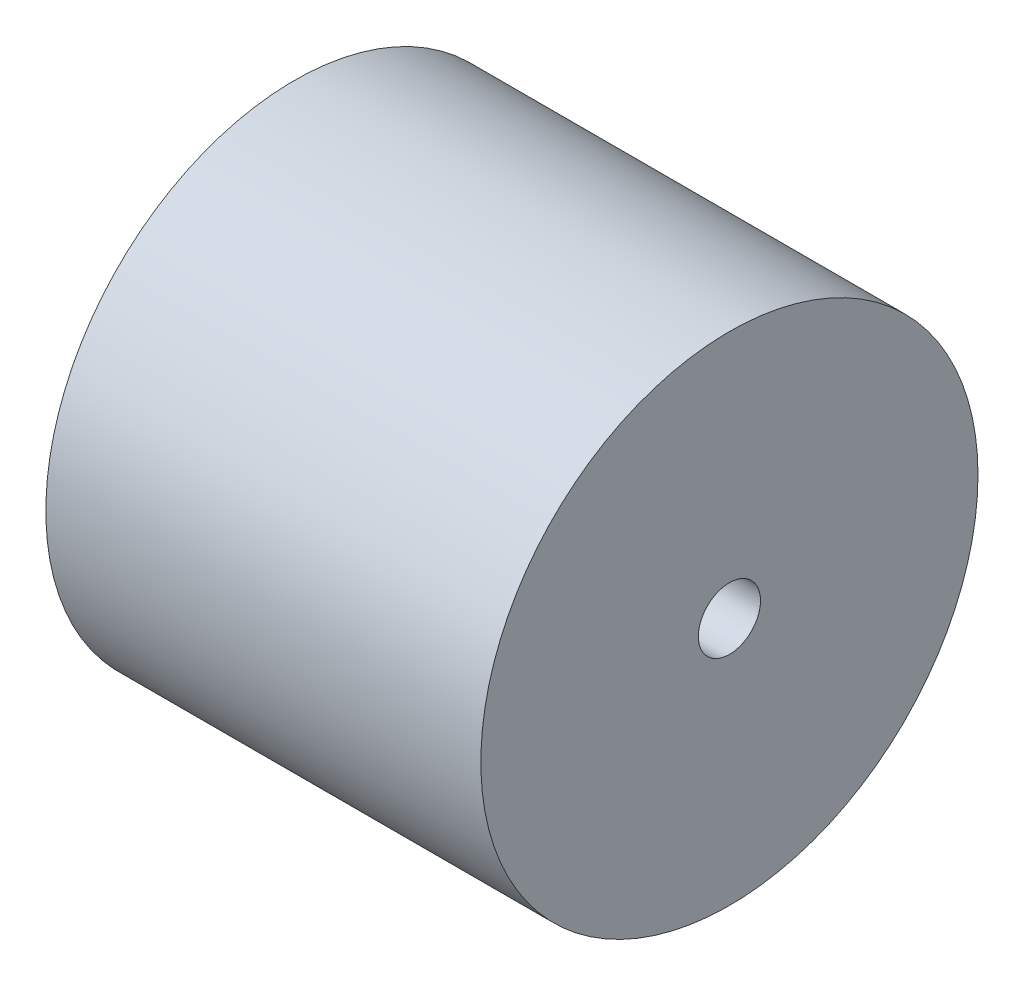
ISO-10303-21;
HEADER;
FILE_DESCRIPTION(('STEP AP214'),'2;1');
FILE_NAME('part.step','',(''),(''),'','','');
FILE_SCHEMA(('AUTOMOTIVE_DESIGN { 1 0 10303 214 1 1 1 1 }'));
ENDSEC;
DATA;
#1=APPLICATION_CONTEXT('core data for automotive mechanical design processes');
#2=APPLICATION_PROTOCOL_DEFINITION('international standard','automotive_design',2000,#1);
#3=PRODUCT_CONTEXT('',#1,'mechanical');
#4=PRODUCT('Part','Part','',(#3));
#5=PRODUCT_RELATED_PRODUCT_CATEGORY('part','',(#4));
#6=PRODUCT_DEFINITION_FORMATION('','',#4);
#7=PRODUCT_DEFINITION_CONTEXT('part definition',#1,'design');
#8=PRODUCT_DEFINITION('design','',#6,#7);
#9=PRODUCT_DEFINITION_SHAPE('','',#8);
#10=(LENGTH_UNIT() NAMED_UNIT(*) SI_UNIT(.MILLI.,.METRE.));
#11=(NAMED_UNIT(*) PLANE_ANGLE_UNIT() SI_UNIT($,.RADIAN.));
#12=(NAMED_UNIT(*) SI_UNIT($,.STERADIAN.) SOLID_ANGLE_UNIT());
#13=UNCERTAINTY_MEASURE_WITH_UNIT(LENGTH_MEASURE(1.E-05),#10,'distance_accuracy_value','');
#14=(GEOMETRIC_REPRESENTATION_CONTEXT(3) GLOBAL_UNCERTAINTY_ASSIGNED_CONTEXT((#13)) GLOBAL_UNIT_ASSIGNED_CONTEXT((#10,
#11,#12)) REPRESENTATION_CONTEXT('',''));
#15=CARTESIAN_POINT('',(0.,0.,0.));
#16=DIRECTION('',(0.,0.,1.));
#17=DIRECTION('',(1.,0.,0.));
#18=AXIS2_PLACEMENT_3D('',#15,#16,#17);
#19=CARTESIAN_POINT('',(44.45,0.,0.));
#20=DIRECTION('',(1.,0.,0.));
#21=DIRECTION('',(0.,0.,-1.));
#22=AXIS2_PLACEMENT_3D('',#19,#20,#21);
#23=PLANE('',#22);
#24=CARTESIAN_POINT('',(44.45,0.,0.));
#25=DIRECTION('',(1.,0.,0.));
#26=DIRECTION('',(0.,0.,-1.));
#27=AXIS2_PLACEMENT_3D('',#24,#25,#26);
#28=CIRCLE('',#27,50.8);
#29=CARTESIAN_POINT('',(44.45,0.,-50.8));
#30=VERTEX_POINT('',#29);
#31=EDGE_CURVE('E10',#30,#30,#28,.T.);
#32=ORIENTED_EDGE('',*,*,#31,.T.);
#33=EDGE_LOOP('',(#32));
#34=FACE_BOUND('',#33,.T.);
#35=CARTESIAN_POINT('',(44.45,0.,0.));
#36=DIRECTION('',(1.,0.,0.));
#37=DIRECTION('',(0.,0.,-1.));
#38=AXIS2_PLACEMENT_3D('',#35,#36,#37);
#39=CIRCLE('',#38,6.35);
#40=CARTESIAN_POINT('',(44.45,0.,-6.35));
#41=VERTEX_POINT('',#40);
#42=EDGE_CURVE('E42',#41,#41,#39,.T.);
#43=ORIENTED_EDGE('',*,*,#42,.F.);
#44=EDGE_LOOP('',(#43));
#45=FACE_BOUND('',#44,.T.);
#46=ADVANCED_FACE('F31',(#34,#45),#23,.T.);
#47=CARTESIAN_POINT('',(-44.45,0.,0.));
#48=DIRECTION('',(1.,0.,0.));
#49=DIRECTION('',(0.,0.,-1.));
#50=AXIS2_PLACEMENT_3D('',#47,#48,#49);
#51=PLANE('',#50);
#52=CARTESIAN_POINT('',(-44.45,0.,0.));
#53=DIRECTION('',(1.,0.,0.));
#54=DIRECTION('',(0.,0.,-1.));
#55=AXIS2_PLACEMENT_3D('',#52,#53,#54);
#56=CIRCLE('',#55,50.8);
#57=CARTESIAN_POINT('',(-44.45,0.,-50.8));
#58=VERTEX_POINT('',#57);
#59=EDGE_CURVE('E35',#58,#58,#56,.T.);
#60=ORIENTED_EDGE('',*,*,#59,.F.);
#61=EDGE_LOOP('',(#60));
#62=FACE_BOUND('',#61,.T.);
#63=CARTESIAN_POINT('',(-44.45,0.,0.));
#64=DIRECTION('',(1.,0.,0.));
#65=DIRECTION('',(0.,0.,-1.));
#66=AXIS2_PLACEMENT_3D('',#63,#64,#65);
#67=CIRCLE('',#66,6.35);
#68=CARTESIAN_POINT('',(-44.45,0.,-6.35));
#69=VERTEX_POINT('',#68);
#70=EDGE_CURVE('E44',#69,#69,#67,.T.);
#71=ORIENTED_EDGE('',*,*,#70,.T.);
#72=EDGE_LOOP('',(#71));
#73=FACE_BOUND('',#72,.T.);
#74=ADVANCED_FACE('F54',(#62,#73),#51,.F.);
#75=CARTESIAN_POINT('',(44.45,0.,0.));
#76=DIRECTION('',(-1.,0.,0.));
#77=DIRECTION('',(0.,0.,1.));
#78=AXIS2_PLACEMENT_3D('',#75,#76,#77);
#79=CYLINDRICAL_SURFACE('',#78,50.8);
#80=ORIENTED_EDGE('',*,*,#31,.F.);
#81=EDGE_LOOP('',(#80));
#82=FACE_BOUND('',#81,.T.);
#83=ORIENTED_EDGE('',*,*,#59,.T.);
#84=EDGE_LOOP('',(#83));
#85=FACE_BOUND('',#84,.T.);
#86=ADVANCED_FACE('F33',(#82,#85),#79,.T.);
#87=CARTESIAN_POINT('',(44.45,0.,0.));
#88=DIRECTION('',(-1.,0.,0.));
#89=DIRECTION('',(0.,0.,1.));
#90=AXIS2_PLACEMENT_3D('',#87,#88,#89);
#91=CYLINDRICAL_SURFACE('',#90,6.35);
#92=ORIENTED_EDGE('',*,*,#42,.T.);
#93=EDGE_LOOP('',(#92));
#94=FACE_BOUND('',#93,.T.);
#95=ORIENTED_EDGE('',*,*,#70,.F.);
#96=EDGE_LOOP('',(#95));
#97=FACE_BOUND('',#96,.T.);
#98=ADVANCED_FACE('F50',(#94,#97),#91,.F.);
#99=CLOSED_SHELL('',(#46,#74,#86,#98));
#100=MANIFOLD_SOLID_BREP('B2',#99);
#101=ADVANCED_BREP_SHAPE_REPRESENTATION('',(#18,#100),#14);
#102=SHAPE_DEFINITION_REPRESENTATION(#9,#101);
ENDSEC;
END-ISO-10303-21;
